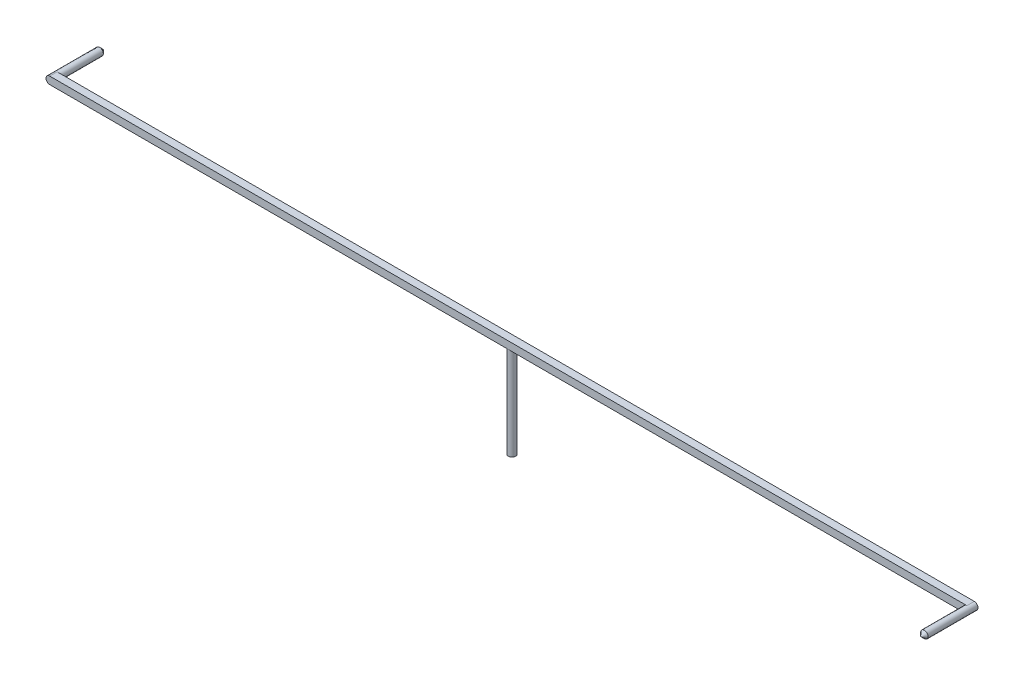
ISO-10303-21;
HEADER;
FILE_DESCRIPTION(('STEP AP214'),'2;1');
FILE_NAME('part.step','',(''),(''),'','','');
FILE_SCHEMA(('AUTOMOTIVE_DESIGN { 1 0 10303 214 1 1 1 1 }'));
ENDSEC;
DATA;
#1=APPLICATION_CONTEXT('core data for automotive mechanical design processes');
#2=APPLICATION_PROTOCOL_DEFINITION('international standard','automotive_design',2000,#1);
#3=PRODUCT_CONTEXT('',#1,'mechanical');
#4=PRODUCT('Part','Part','',(#3));
#5=PRODUCT_RELATED_PRODUCT_CATEGORY('part','',(#4));
#6=PRODUCT_DEFINITION_FORMATION('','',#4);
#7=PRODUCT_DEFINITION_CONTEXT('part definition',#1,'design');
#8=PRODUCT_DEFINITION('design','',#6,#7);
#9=PRODUCT_DEFINITION_SHAPE('','',#8);
#10=(LENGTH_UNIT() NAMED_UNIT(*) SI_UNIT(.MILLI.,.METRE.));
#11=(NAMED_UNIT(*) PLANE_ANGLE_UNIT() SI_UNIT($,.RADIAN.));
#12=(NAMED_UNIT(*) SI_UNIT($,.STERADIAN.) SOLID_ANGLE_UNIT());
#13=UNCERTAINTY_MEASURE_WITH_UNIT(LENGTH_MEASURE(1.E-05),#10,'distance_accuracy_value','');
#14=(GEOMETRIC_REPRESENTATION_CONTEXT(3) GLOBAL_UNCERTAINTY_ASSIGNED_CONTEXT((#13)) GLOBAL_UNIT_ASSIGNED_CONTEXT((#10,
#11,#12)) REPRESENTATION_CONTEXT('',''));
#15=CARTESIAN_POINT('',(0.,0.,0.));
#16=DIRECTION('',(0.,0.,1.));
#17=DIRECTION('',(1.,0.,0.));
#18=AXIS2_PLACEMENT_3D('',#15,#16,#17);
#19=CARTESIAN_POINT('',(0.,10.,0.));
#20=DIRECTION('',(0.,-1.,0.));
#21=DIRECTION('',(0.,0.,-1.));
#22=AXIS2_PLACEMENT_3D('',#19,#20,#21);
#23=CYLINDRICAL_SURFACE('',#22,0.4);
#24=CARTESIAN_POINT('',(0.,10.,0.));
#25=DIRECTION('',(0.,1.,0.));
#26=DIRECTION('',(0.,0.,1.));
#27=AXIS2_PLACEMENT_3D('',#24,#25,#26);
#28=CIRCLE('',#27,0.4);
#29=CARTESIAN_POINT('',(0.,10.,0.4));
#30=VERTEX_POINT('',#29);
#31=CARTESIAN_POINT('',(0.,10.,-0.4));
#32=VERTEX_POINT('',#31);
#33=EDGE_CURVE('E164',#30,#32,#28,.T.);
#34=ORIENTED_EDGE('',*,*,#33,.F.);
#35=EDGE_CURVE('E167',#32,#30,#28,.T.);
#36=ORIENTED_EDGE('',*,*,#35,.F.);
#37=EDGE_LOOP('',(#34,#36));
#38=FACE_BOUND('',#37,.T.);
#39=CARTESIAN_POINT('',(0.,0.,0.));
#40=DIRECTION('',(0.,1.,0.));
#41=DIRECTION('',(0.,0.,1.));
#42=AXIS2_PLACEMENT_3D('',#39,#40,#41);
#43=CIRCLE('',#42,0.4);
#44=CARTESIAN_POINT('',(0.,0.,0.4));
#45=VERTEX_POINT('',#44);
#46=EDGE_CURVE('E153',#45,#45,#43,.T.);
#47=ORIENTED_EDGE('',*,*,#46,.T.);
#48=EDGE_LOOP('',(#47));
#49=FACE_BOUND('',#48,.T.);
#50=ADVANCED_FACE('F35',(#38,#49),#23,.T.);
#51=CARTESIAN_POINT('',(0.,0.,0.));
#52=DIRECTION('',(0.,1.,0.));
#53=DIRECTION('',(0.,0.,1.));
#54=AXIS2_PLACEMENT_3D('',#51,#52,#53);
#55=PLANE('',#54);
#56=ORIENTED_EDGE('',*,*,#46,.F.);
#57=EDGE_LOOP('',(#56));
#58=FACE_BOUND('',#57,.T.);
#59=ADVANCED_FACE('F77',(#58),#55,.F.);
#60=CARTESIAN_POINT('',(0.,10.,0.));
#61=DIRECTION('',(0.,1.,0.));
#62=DIRECTION('',(0.,0.,1.));
#63=AXIS2_PLACEMENT_3D('',#60,#61,#62);
#64=PLANE('',#63);
#65=DIRECTION('',(-1.,0.,0.));
#66=VECTOR('',#65,1.);
#67=CARTESIAN_POINT('',(-50.,10.,-0.4));
#68=LINE('',#67,#66);
#69=CARTESIAN_POINT('',(49.6,10.,-0.4));
#70=VERTEX_POINT('',#69);
#71=EDGE_CURVE('E151',#70,#32,#68,.T.);
#72=ORIENTED_EDGE('',*,*,#71,.F.);
#73=DIRECTION('',(0.,0.,-1.));
#74=VECTOR('',#73,1.);
#75=CARTESIAN_POINT('',(49.6,10.,0.));
#76=LINE('',#75,#74);
#77=CARTESIAN_POINT('',(49.6,10.,0.4));
#78=VERTEX_POINT('',#77);
#79=EDGE_CURVE('E119',#70,#78,#76,.F.);
#80=ORIENTED_EDGE('',*,*,#79,.T.);
#81=DIRECTION('',(1.,0.,0.));
#82=VECTOR('',#81,1.);
#83=CARTESIAN_POINT('',(-50.,10.,0.4));
#84=LINE('',#83,#82);
#85=EDGE_CURVE('E128',#30,#78,#84,.T.);
#86=ORIENTED_EDGE('',*,*,#85,.F.);
#87=ORIENTED_EDGE('',*,*,#33,.T.);
#88=EDGE_LOOP('',(#72,#80,#86,#87));
#89=FACE_BOUND('',#88,.T.);
#90=ADVANCED_FACE('F83',(#89),#64,.F.);
#91=CARTESIAN_POINT('',(-49.6,10.,0.4));
#92=VERTEX_POINT('',#91);
#93=EDGE_CURVE('E161',#92,#30,#84,.T.);
#94=ORIENTED_EDGE('',*,*,#93,.F.);
#95=DIRECTION('',(0.,0.,1.));
#96=VECTOR('',#95,1.);
#97=CARTESIAN_POINT('',(-49.6,10.,0.));
#98=LINE('',#97,#96);
#99=CARTESIAN_POINT('',(-49.6,10.,-0.4));
#100=VERTEX_POINT('',#99);
#101=EDGE_CURVE('E173',#92,#100,#98,.F.);
#102=ORIENTED_EDGE('',*,*,#101,.T.);
#103=EDGE_CURVE('E156',#32,#100,#68,.T.);
#104=ORIENTED_EDGE('',*,*,#103,.F.);
#105=ORIENTED_EDGE('',*,*,#35,.T.);
#106=EDGE_LOOP('',(#94,#102,#104,#105));
#107=FACE_BOUND('',#106,.T.);
#108=ADVANCED_FACE('F179',(#107),#64,.F.);
#109=CARTESIAN_POINT('',(-50.,10.8,0.4));
#110=DIRECTION('',(0.,0.,-1.));
#111=DIRECTION('',(-1.,0.,0.));
#112=AXIS2_PLACEMENT_3D('',#109,#110,#111);
#113=PLANE('',#112);
#114=CARTESIAN_POINT('',(49.6,10.4,0.4));
#115=DIRECTION('',(0.,0.,1.));
#116=DIRECTION('',(1.,0.,0.));
#117=AXIS2_PLACEMENT_3D('',#114,#115,#116);
#118=CIRCLE('',#117,0.399999999999998);
#119=CARTESIAN_POINT('',(49.6,10.8,0.4));
#120=VERTEX_POINT('',#119);
#121=EDGE_CURVE('E108',#120,#78,#118,.T.);
#122=ORIENTED_EDGE('',*,*,#121,.F.);
#123=DIRECTION('',(1.,0.,0.));
#124=VECTOR('',#123,1.);
#125=CARTESIAN_POINT('',(-50.,10.8,0.4));
#126=LINE('',#125,#124);
#127=CARTESIAN_POINT('',(-49.6,10.8,0.4));
#128=VERTEX_POINT('',#127);
#129=EDGE_CURVE('E144',#128,#120,#126,.T.);
#130=ORIENTED_EDGE('',*,*,#129,.F.);
#131=CARTESIAN_POINT('',(-49.6,10.4,0.4));
#132=DIRECTION('',(0.,0.,-1.));
#133=DIRECTION('',(-1.,0.,0.));
#134=AXIS2_PLACEMENT_3D('',#131,#132,#133);
#135=CIRCLE('',#134,0.4);
#136=CARTESIAN_POINT('',(-50.,10.4,0.4));
#137=VERTEX_POINT('',#136);
#138=EDGE_CURVE('E142',#128,#137,#135,.F.);
#139=ORIENTED_EDGE('',*,*,#138,.T.);
#140=CARTESIAN_POINT('',(-49.6,10.4,0.4));
#141=DIRECTION('',(0.,0.,-1.));
#142=DIRECTION('',(-1.,0.,0.));
#143=AXIS2_PLACEMENT_3D('',#140,#141,#142);
#144=CIRCLE('',#143,0.4);
#145=EDGE_CURVE('E171',#137,#92,#144,.F.);
#146=ORIENTED_EDGE('',*,*,#145,.T.);
#147=ORIENTED_EDGE('',*,*,#93,.T.);
#148=ORIENTED_EDGE('',*,*,#85,.T.);
#149=EDGE_LOOP('',(#122,#130,#139,#146,#147,#148));
#150=FACE_BOUND('',#149,.T.);
#151=ADVANCED_FACE('F148',(#150),#113,.F.);
#152=CARTESIAN_POINT('',(-50.,10.8,-0.4));
#153=DIRECTION('',(0.,0.,1.));
#154=DIRECTION('',(1.,0.,0.));
#155=AXIS2_PLACEMENT_3D('',#152,#153,#154);
#156=PLANE('',#155);
#157=CARTESIAN_POINT('',(-49.6,10.4,-0.4));
#158=DIRECTION('',(0.,0.,-1.));
#159=DIRECTION('',(-1.,0.,0.));
#160=AXIS2_PLACEMENT_3D('',#157,#158,#159);
#161=CIRCLE('',#160,0.399999999999998);
#162=CARTESIAN_POINT('',(-49.6,10.8,-0.4));
#163=VERTEX_POINT('',#162);
#164=EDGE_CURVE('E139',#163,#100,#161,.T.);
#165=ORIENTED_EDGE('',*,*,#164,.F.);
#166=DIRECTION('',(-1.,0.,0.));
#167=VECTOR('',#166,1.);
#168=CARTESIAN_POINT('',(-50.,10.8,-0.4));
#169=LINE('',#168,#167);
#170=CARTESIAN_POINT('',(49.6,10.8,-0.4));
#171=VERTEX_POINT('',#170);
#172=EDGE_CURVE('E145',#171,#163,#169,.T.);
#173=ORIENTED_EDGE('',*,*,#172,.F.);
#174=CARTESIAN_POINT('',(49.6,10.4,-0.4));
#175=DIRECTION('',(0.,0.,1.));
#176=DIRECTION('',(1.,0.,0.));
#177=AXIS2_PLACEMENT_3D('',#174,#175,#176);
#178=CIRCLE('',#177,0.4);
#179=CARTESIAN_POINT('',(50.,10.4,-0.4));
#180=VERTEX_POINT('',#179);
#181=EDGE_CURVE('E52',#171,#180,#178,.F.);
#182=ORIENTED_EDGE('',*,*,#181,.T.);
#183=CARTESIAN_POINT('',(49.6,10.4,-0.4));
#184=DIRECTION('',(0.,0.,1.));
#185=DIRECTION('',(1.,0.,0.));
#186=AXIS2_PLACEMENT_3D('',#183,#184,#185);
#187=CIRCLE('',#186,0.4);
#188=EDGE_CURVE('E116',#180,#70,#187,.F.);
#189=ORIENTED_EDGE('',*,*,#188,.T.);
#190=ORIENTED_EDGE('',*,*,#71,.T.);
#191=ORIENTED_EDGE('',*,*,#103,.T.);
#192=EDGE_LOOP('',(#165,#173,#182,#189,#190,#191));
#193=FACE_BOUND('',#192,.T.);
#194=ADVANCED_FACE('F186',(#193),#156,.F.);
#195=CARTESIAN_POINT('',(0.,10.8,0.));
#196=DIRECTION('',(0.,1.,0.));
#197=DIRECTION('',(0.,0.,1.));
#198=AXIS2_PLACEMENT_3D('',#195,#196,#197);
#199=PLANE('',#198);
#200=ORIENTED_EDGE('',*,*,#172,.T.);
#201=DIRECTION('',(0.,0.,1.));
#202=VECTOR('',#201,1.);
#203=CARTESIAN_POINT('',(-49.6,10.8,0.4));
#204=LINE('',#203,#202);
#205=EDGE_CURVE('E115',#163,#128,#204,.T.);
#206=ORIENTED_EDGE('',*,*,#205,.T.);
#207=ORIENTED_EDGE('',*,*,#129,.T.);
#208=DIRECTION('',(0.,0.,-1.));
#209=VECTOR('',#208,1.);
#210=CARTESIAN_POINT('',(49.6,10.8,-0.4));
#211=LINE('',#210,#209);
#212=EDGE_CURVE('E104',#120,#171,#211,.T.);
#213=ORIENTED_EDGE('',*,*,#212,.T.);
#214=EDGE_LOOP('',(#200,#206,#207,#213));
#215=FACE_BOUND('',#214,.T.);
#216=ADVANCED_FACE('F93',(#215),#199,.T.);
#217=CARTESIAN_POINT('',(-49.6,10.4,0.));
#218=DIRECTION('',(0.,0.,-1.));
#219=DIRECTION('',(-1.,0.,0.));
#220=AXIS2_PLACEMENT_3D('',#217,#218,#219);
#221=CYLINDRICAL_SURFACE('',#220,0.4);
#222=CARTESIAN_POINT('',(-49.6,10.4,-4.99999999999999));
#223=DIRECTION('',(0.,0.,-1.));
#224=DIRECTION('',(-1.,0.,0.));
#225=AXIS2_PLACEMENT_3D('',#222,#223,#224);
#226=CIRCLE('',#225,0.4);
#227=CARTESIAN_POINT('',(-50.,10.4,-4.99999999999999));
#228=VERTEX_POINT('',#227);
#229=EDGE_CURVE('E44',#228,#228,#226,.F.);
#230=ORIENTED_EDGE('',*,*,#229,.T.);
#231=EDGE_LOOP('',(#230));
#232=FACE_BOUND('',#231,.T.);
#233=ORIENTED_EDGE('',*,*,#205,.F.);
#234=ORIENTED_EDGE('',*,*,#164,.T.);
#235=ORIENTED_EDGE('',*,*,#101,.F.);
#236=ORIENTED_EDGE('',*,*,#145,.F.);
#237=DIRECTION('',(0.,0.,1.));
#238=VECTOR('',#237,1.);
#239=CARTESIAN_POINT('',(-50.,10.4,-0.4));
#240=LINE('',#239,#238);
#241=CARTESIAN_POINT('',(-50.,10.4,-0.4));
#242=VERTEX_POINT('',#241);
#243=EDGE_CURVE('E126',#137,#242,#240,.F.);
#244=ORIENTED_EDGE('',*,*,#243,.T.);
#245=ORIENTED_EDGE('',*,*,#243,.F.);
#246=ORIENTED_EDGE('',*,*,#138,.F.);
#247=EDGE_LOOP('',(#233,#234,#235,#236,#244,#245,#246));
#248=FACE_BOUND('',#247,.T.);
#249=ADVANCED_FACE('F90',(#232,#248),#221,.T.);
#250=CARTESIAN_POINT('',(49.6,10.4,0.));
#251=DIRECTION('',(0.,0.,1.));
#252=DIRECTION('',(1.,0.,0.));
#253=AXIS2_PLACEMENT_3D('',#250,#251,#252);
#254=CYLINDRICAL_SURFACE('',#253,0.4);
#255=CARTESIAN_POINT('',(49.6,10.4,4.99999999999999));
#256=DIRECTION('',(0.,0.,1.));
#257=DIRECTION('',(1.,0.,0.));
#258=AXIS2_PLACEMENT_3D('',#255,#256,#257);
#259=CIRCLE('',#258,0.4);
#260=CARTESIAN_POINT('',(50.,10.4,4.99999999999999));
#261=VERTEX_POINT('',#260);
#262=EDGE_CURVE('E11',#261,#261,#259,.F.);
#263=ORIENTED_EDGE('',*,*,#262,.T.);
#264=EDGE_LOOP('',(#263));
#265=FACE_BOUND('',#264,.T.);
#266=ORIENTED_EDGE('',*,*,#212,.F.);
#267=ORIENTED_EDGE('',*,*,#121,.T.);
#268=ORIENTED_EDGE('',*,*,#79,.F.);
#269=ORIENTED_EDGE('',*,*,#188,.F.);
#270=DIRECTION('',(0.,0.,-1.));
#271=VECTOR('',#270,1.);
#272=CARTESIAN_POINT('',(50.,10.4,0.4));
#273=LINE('',#272,#271);
#274=CARTESIAN_POINT('',(50.,10.4,0.4));
#275=VERTEX_POINT('',#274);
#276=EDGE_CURVE('E129',#180,#275,#273,.F.);
#277=ORIENTED_EDGE('',*,*,#276,.T.);
#278=ORIENTED_EDGE('',*,*,#276,.F.);
#279=ORIENTED_EDGE('',*,*,#181,.F.);
#280=EDGE_LOOP('',(#266,#267,#268,#269,#277,#278,#279));
#281=FACE_BOUND('',#280,.T.);
#282=ADVANCED_FACE('F73',(#265,#281),#254,.T.);
#283=CARTESIAN_POINT('',(-49.6,10.4,-4.99999999999999));
#284=DIRECTION('',(0.,0.,1.));
#285=DIRECTION('',(1.,0.,0.));
#286=AXIS2_PLACEMENT_3D('',#283,#284,#285);
#287=CONICAL_SURFACE('',#286,0.400000000000011,0.785398163397447);
#288=ORIENTED_EDGE('',*,*,#229,.F.);
#289=EDGE_LOOP('',(#288));
#290=FACE_BOUND('',#289,.T.);
#291=CARTESIAN_POINT('',(-49.6,10.4,-5.4));
#292=VERTEX_POINT('',#291);
#293=VERTEX_LOOP('',#292);
#294=FACE_BOUND('',#293,.T.);
#295=ADVANCED_FACE('F68',(#290,#294),#287,.T.);
#296=CARTESIAN_POINT('',(49.6,10.4,4.99999999999999));
#297=DIRECTION('',(0.,0.,-1.));
#298=DIRECTION('',(-1.,0.,0.));
#299=AXIS2_PLACEMENT_3D('',#296,#297,#298);
#300=CONICAL_SURFACE('',#299,0.400000000000011,0.785398163397447);
#301=ORIENTED_EDGE('',*,*,#262,.F.);
#302=EDGE_LOOP('',(#301));
#303=FACE_BOUND('',#302,.T.);
#304=CARTESIAN_POINT('',(49.6,10.4,5.4));
#305=VERTEX_POINT('',#304);
#306=VERTEX_LOOP('',#305);
#307=FACE_BOUND('',#306,.T.);
#308=ADVANCED_FACE('F37',(#303,#307),#300,.T.);
#309=CLOSED_SHELL('',(#50,#59,#90,#108,#151,#194,#216,#249,#282,#295,#308));
#310=MANIFOLD_SOLID_BREP('B2',#309);
#311=ADVANCED_BREP_SHAPE_REPRESENTATION('',(#18,#310),#14);
#312=SHAPE_DEFINITION_REPRESENTATION(#9,#311);
ENDSEC;
END-ISO-10303-21;
